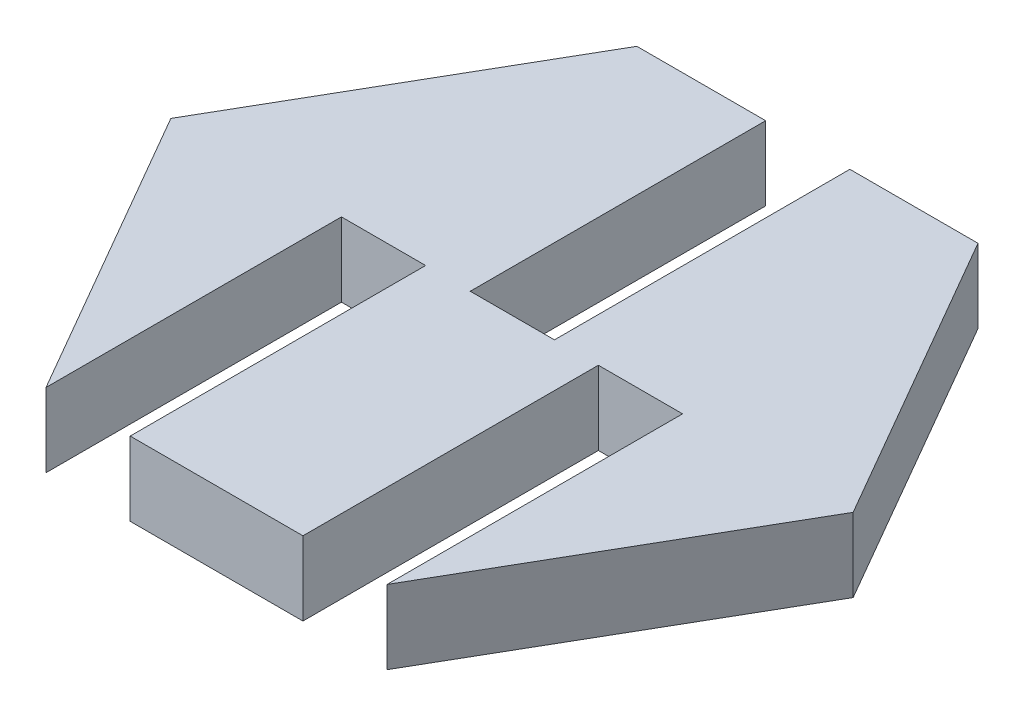
ISO-10303-21;
HEADER;
FILE_DESCRIPTION(('STEP AP214'),'2;1');
FILE_NAME('part.step','',(''),(''),'','','');
FILE_SCHEMA(('AUTOMOTIVE_DESIGN { 1 0 10303 214 1 1 1 1 }'));
ENDSEC;
DATA;
#1=APPLICATION_CONTEXT('core data for automotive mechanical design processes');
#2=APPLICATION_PROTOCOL_DEFINITION('international standard','automotive_design',2000,#1);
#3=PRODUCT_CONTEXT('',#1,'mechanical');
#4=PRODUCT('Part','Part','',(#3));
#5=PRODUCT_RELATED_PRODUCT_CATEGORY('part','',(#4));
#6=PRODUCT_DEFINITION_FORMATION('','',#4);
#7=PRODUCT_DEFINITION_CONTEXT('part definition',#1,'design');
#8=PRODUCT_DEFINITION('design','',#6,#7);
#9=PRODUCT_DEFINITION_SHAPE('','',#8);
#10=(LENGTH_UNIT() NAMED_UNIT(*) SI_UNIT(.MILLI.,.METRE.));
#11=(NAMED_UNIT(*) PLANE_ANGLE_UNIT() SI_UNIT($,.RADIAN.));
#12=(NAMED_UNIT(*) SI_UNIT($,.STERADIAN.) SOLID_ANGLE_UNIT());
#13=UNCERTAINTY_MEASURE_WITH_UNIT(LENGTH_MEASURE(1.E-05),#10,'distance_accuracy_value','');
#14=(GEOMETRIC_REPRESENTATION_CONTEXT(3) GLOBAL_UNCERTAINTY_ASSIGNED_CONTEXT((#13)) GLOBAL_UNIT_ASSIGNED_CONTEXT((#10,
#11,#12)) REPRESENTATION_CONTEXT('',''));
#15=CARTESIAN_POINT('',(0.,0.,0.));
#16=DIRECTION('',(0.,0.,1.));
#17=DIRECTION('',(1.,0.,0.));
#18=AXIS2_PLACEMENT_3D('',#15,#16,#17);
#19=CARTESIAN_POINT('',(5.77350269189625,2.5,-10.));
#20=DIRECTION('',(0.,0.,1.));
#21=DIRECTION('',(1.,0.,0.));
#22=AXIS2_PLACEMENT_3D('',#19,#20,#21);
#23=PLANE('',#22);
#24=DIRECTION('',(-1.,0.,0.));
#25=VECTOR('',#24,1.);
#26=CARTESIAN_POINT('',(5.77350269189625,2.5,-10.));
#27=LINE('',#26,#25);
#28=CARTESIAN_POINT('',(-1.41350269189626,2.5,-10.));
#29=VERTEX_POINT('',#28);
#30=CARTESIAN_POINT('',(-5.77350269189626,2.5,-10.));
#31=VERTEX_POINT('',#30);
#32=EDGE_CURVE('E267',#29,#31,#27,.T.);
#33=ORIENTED_EDGE('',*,*,#32,.F.);
#34=DIRECTION('',(0.,1.,0.));
#35=VECTOR('',#34,1.);
#36=CARTESIAN_POINT('',(-1.41350269189626,2.5,-10.));
#37=LINE('',#36,#35);
#38=CARTESIAN_POINT('',(-1.41350269189626,0.,-10.));
#39=VERTEX_POINT('',#38);
#40=EDGE_CURVE('E159',#39,#29,#37,.T.);
#41=ORIENTED_EDGE('',*,*,#40,.F.);
#42=DIRECTION('',(-1.,0.,0.));
#43=VECTOR('',#42,1.);
#44=CARTESIAN_POINT('',(5.77350269189625,0.,-10.));
#45=LINE('',#44,#43);
#46=CARTESIAN_POINT('',(-5.77350269189626,0.,-10.));
#47=VERTEX_POINT('',#46);
#48=EDGE_CURVE('E289',#39,#47,#45,.T.);
#49=ORIENTED_EDGE('',*,*,#48,.T.);
#50=DIRECTION('',(0.,-1.,0.));
#51=VECTOR('',#50,1.);
#52=CARTESIAN_POINT('',(-5.77350269189626,2.5,-10.));
#53=LINE('',#52,#51);
#54=EDGE_CURVE('E314',#31,#47,#53,.T.);
#55=ORIENTED_EDGE('',*,*,#54,.F.);
#56=EDGE_LOOP('',(#33,#41,#49,#55));
#57=FACE_BOUND('',#56,.T.);
#58=ADVANCED_FACE('F39',(#57),#23,.F.);
#59=CARTESIAN_POINT('',(5.77350269189625,2.5,10.));
#60=DIRECTION('',(-0.866025403784439,0.,-0.5));
#61=DIRECTION('',(-0.5,0.,0.866025403784439));
#62=AXIS2_PLACEMENT_3D('',#59,#60,#61);
#63=PLANE('',#62);
#64=DIRECTION('',(0.5,0.,-0.866025403784439));
#65=VECTOR('',#64,1.);
#66=CARTESIAN_POINT('',(5.77350269189625,0.,10.));
#67=LINE('',#66,#65);
#68=CARTESIAN_POINT('',(5.77350269189625,0.,10.));
#69=VERTEX_POINT('',#68);
#70=CARTESIAN_POINT('',(11.5470053837925,0.,0.));
#71=VERTEX_POINT('',#70);
#72=EDGE_CURVE('E248',#69,#71,#67,.T.);
#73=ORIENTED_EDGE('',*,*,#72,.T.);
#74=DIRECTION('',(0.,-1.,0.));
#75=VECTOR('',#74,1.);
#76=CARTESIAN_POINT('',(11.5470053837925,2.5,0.));
#77=LINE('',#76,#75);
#78=CARTESIAN_POINT('',(11.5470053837925,2.5,0.));
#79=VERTEX_POINT('',#78);
#80=EDGE_CURVE('E11',#79,#71,#77,.T.);
#81=ORIENTED_EDGE('',*,*,#80,.F.);
#82=DIRECTION('',(0.5,0.,-0.866025403784439));
#83=VECTOR('',#82,1.);
#84=CARTESIAN_POINT('',(5.77350269189625,2.5,10.));
#85=LINE('',#84,#83);
#86=CARTESIAN_POINT('',(5.77350269189625,2.5,10.));
#87=VERTEX_POINT('',#86);
#88=EDGE_CURVE('E259',#87,#79,#85,.T.);
#89=ORIENTED_EDGE('',*,*,#88,.F.);
#90=DIRECTION('',(0.,-1.,0.));
#91=VECTOR('',#90,1.);
#92=CARTESIAN_POINT('',(5.77350269189625,2.5,10.));
#93=LINE('',#92,#91);
#94=EDGE_CURVE('E282',#87,#69,#93,.T.);
#95=ORIENTED_EDGE('',*,*,#94,.T.);
#96=EDGE_LOOP('',(#73,#81,#89,#95));
#97=FACE_BOUND('',#96,.T.);
#98=ADVANCED_FACE('F41',(#97),#63,.F.);
#99=CARTESIAN_POINT('',(11.5470053837925,2.5,0.));
#100=DIRECTION('',(-0.866025403784439,0.,0.5));
#101=DIRECTION('',(0.5,0.,0.866025403784439));
#102=AXIS2_PLACEMENT_3D('',#99,#100,#101);
#103=PLANE('',#102);
#104=DIRECTION('',(-0.5,0.,-0.866025403784438));
#105=VECTOR('',#104,1.);
#106=CARTESIAN_POINT('',(11.5470053837925,0.,0.));
#107=LINE('',#106,#105);
#108=CARTESIAN_POINT('',(5.77350269189625,0.,-10.));
#109=VERTEX_POINT('',#108);
#110=EDGE_CURVE('E286',#71,#109,#107,.T.);
#111=ORIENTED_EDGE('',*,*,#110,.T.);
#112=DIRECTION('',(0.,-1.,0.));
#113=VECTOR('',#112,1.);
#114=CARTESIAN_POINT('',(5.77350269189625,2.5,-10.));
#115=LINE('',#114,#113);
#116=CARTESIAN_POINT('',(5.77350269189625,2.5,-10.));
#117=VERTEX_POINT('',#116);
#118=EDGE_CURVE('E48',#117,#109,#115,.T.);
#119=ORIENTED_EDGE('',*,*,#118,.F.);
#120=DIRECTION('',(-0.5,0.,-0.866025403784438));
#121=VECTOR('',#120,1.);
#122=CARTESIAN_POINT('',(11.5470053837925,2.5,0.));
#123=LINE('',#122,#121);
#124=EDGE_CURVE('E263',#79,#117,#123,.T.);
#125=ORIENTED_EDGE('',*,*,#124,.F.);
#126=ORIENTED_EDGE('',*,*,#80,.T.);
#127=EDGE_LOOP('',(#111,#119,#125,#126));
#128=FACE_BOUND('',#127,.T.);
#129=ADVANCED_FACE('F334',(#128),#103,.F.);
#130=CARTESIAN_POINT('',(1.43649730810374,0.,-10.));
#131=VERTEX_POINT('',#130);
#132=EDGE_CURVE('E290',#109,#131,#45,.T.);
#133=ORIENTED_EDGE('',*,*,#132,.T.);
#134=DIRECTION('',(0.,-1.,0.));
#135=VECTOR('',#134,1.);
#136=CARTESIAN_POINT('',(1.43649730810374,2.5,-10.));
#137=LINE('',#136,#135);
#138=CARTESIAN_POINT('',(1.43649730810374,2.5,-10.));
#139=VERTEX_POINT('',#138);
#140=EDGE_CURVE('E173',#139,#131,#137,.T.);
#141=ORIENTED_EDGE('',*,*,#140,.F.);
#142=EDGE_CURVE('E268',#117,#139,#27,.T.);
#143=ORIENTED_EDGE('',*,*,#142,.F.);
#144=ORIENTED_EDGE('',*,*,#118,.T.);
#145=EDGE_LOOP('',(#133,#141,#143,#144));
#146=FACE_BOUND('',#145,.T.);
#147=ADVANCED_FACE('F323',(#146),#23,.F.);
#148=CARTESIAN_POINT('',(-5.77350269189626,2.5,-10.));
#149=DIRECTION('',(0.866025403784439,0.,0.5));
#150=DIRECTION('',(0.5,0.,-0.866025403784439));
#151=AXIS2_PLACEMENT_3D('',#148,#149,#150);
#152=PLANE('',#151);
#153=DIRECTION('',(-0.5,0.,0.866025403784439));
#154=VECTOR('',#153,1.);
#155=CARTESIAN_POINT('',(-5.77350269189626,0.,-10.));
#156=LINE('',#155,#154);
#157=CARTESIAN_POINT('',(-11.5470053837925,0.,0.));
#158=VERTEX_POINT('',#157);
#159=EDGE_CURVE('E294',#47,#158,#156,.T.);
#160=ORIENTED_EDGE('',*,*,#159,.T.);
#161=DIRECTION('',(0.,-1.,0.));
#162=VECTOR('',#161,1.);
#163=CARTESIAN_POINT('',(-11.5470053837925,2.5,0.));
#164=LINE('',#163,#162);
#165=CARTESIAN_POINT('',(-11.5470053837925,2.5,0.));
#166=VERTEX_POINT('',#165);
#167=EDGE_CURVE('E310',#166,#158,#164,.T.);
#168=ORIENTED_EDGE('',*,*,#167,.F.);
#169=DIRECTION('',(-0.5,0.,0.866025403784439));
#170=VECTOR('',#169,1.);
#171=CARTESIAN_POINT('',(-5.77350269189626,2.5,-10.));
#172=LINE('',#171,#170);
#173=EDGE_CURVE('E271',#31,#166,#172,.T.);
#174=ORIENTED_EDGE('',*,*,#173,.F.);
#175=ORIENTED_EDGE('',*,*,#54,.T.);
#176=EDGE_LOOP('',(#160,#168,#174,#175));
#177=FACE_BOUND('',#176,.T.);
#178=ADVANCED_FACE('F360',(#177),#152,.F.);
#179=CARTESIAN_POINT('',(-11.5470053837925,2.5,0.));
#180=DIRECTION('',(0.866025403784439,0.,-0.5));
#181=DIRECTION('',(-0.5,0.,-0.866025403784439));
#182=AXIS2_PLACEMENT_3D('',#179,#180,#181);
#183=PLANE('',#182);
#184=DIRECTION('',(0.5,0.,0.866025403784439));
#185=VECTOR('',#184,1.);
#186=CARTESIAN_POINT('',(-11.5470053837925,0.,0.));
#187=LINE('',#186,#185);
#188=CARTESIAN_POINT('',(-5.77350269189626,0.,10.));
#189=VERTEX_POINT('',#188);
#190=EDGE_CURVE('E297',#158,#189,#187,.T.);
#191=ORIENTED_EDGE('',*,*,#190,.T.);
#192=DIRECTION('',(0.,-1.,0.));
#193=VECTOR('',#192,1.);
#194=CARTESIAN_POINT('',(-5.77350269189626,2.5,10.));
#195=LINE('',#194,#193);
#196=CARTESIAN_POINT('',(-5.77350269189626,2.5,10.));
#197=VERTEX_POINT('',#196);
#198=EDGE_CURVE('E307',#197,#189,#195,.T.);
#199=ORIENTED_EDGE('',*,*,#198,.F.);
#200=DIRECTION('',(0.5,0.,0.866025403784439));
#201=VECTOR('',#200,1.);
#202=CARTESIAN_POINT('',(-11.5470053837925,2.5,0.));
#203=LINE('',#202,#201);
#204=EDGE_CURVE('E274',#166,#197,#203,.T.);
#205=ORIENTED_EDGE('',*,*,#204,.F.);
#206=ORIENTED_EDGE('',*,*,#167,.T.);
#207=EDGE_LOOP('',(#191,#199,#205,#206));
#208=FACE_BOUND('',#207,.T.);
#209=ADVANCED_FACE('F365',(#208),#183,.F.);
#210=CARTESIAN_POINT('',(-5.77350269189626,2.5,10.));
#211=DIRECTION('',(0.,0.,-1.));
#212=DIRECTION('',(-1.,0.,0.));
#213=AXIS2_PLACEMENT_3D('',#210,#211,#212);
#214=PLANE('',#213);
#215=DIRECTION('',(1.,0.,0.));
#216=VECTOR('',#215,1.);
#217=CARTESIAN_POINT('',(-5.77350269189626,0.,10.));
#218=LINE('',#217,#216);
#219=CARTESIAN_POINT('',(-2.92350269189626,0.,10.));
#220=VERTEX_POINT('',#219);
#221=CARTESIAN_POINT('',(2.92350269189626,0.,10.));
#222=VERTEX_POINT('',#221);
#223=EDGE_CURVE('E264',#220,#222,#218,.T.);
#224=ORIENTED_EDGE('',*,*,#223,.T.);
#225=DIRECTION('',(0.,-1.,0.));
#226=VECTOR('',#225,1.);
#227=CARTESIAN_POINT('',(2.92350269189625,2.5,10.));
#228=LINE('',#227,#226);
#229=CARTESIAN_POINT('',(2.92350269189625,2.5,10.));
#230=VERTEX_POINT('',#229);
#231=EDGE_CURVE('E191',#230,#222,#228,.T.);
#232=ORIENTED_EDGE('',*,*,#231,.F.);
#233=DIRECTION('',(1.,0.,0.));
#234=VECTOR('',#233,1.);
#235=CARTESIAN_POINT('',(-5.77350269189626,2.5,10.));
#236=LINE('',#235,#234);
#237=CARTESIAN_POINT('',(-2.92350269189626,2.5,10.));
#238=VERTEX_POINT('',#237);
#239=EDGE_CURVE('E278',#238,#230,#236,.T.);
#240=ORIENTED_EDGE('',*,*,#239,.F.);
#241=DIRECTION('',(0.,1.,0.));
#242=VECTOR('',#241,1.);
#243=CARTESIAN_POINT('',(-2.92350269189626,2.5,10.));
#244=LINE('',#243,#242);
#245=EDGE_CURVE('E216',#220,#238,#244,.T.);
#246=ORIENTED_EDGE('',*,*,#245,.F.);
#247=EDGE_LOOP('',(#224,#232,#240,#246));
#248=FACE_BOUND('',#247,.T.);
#249=ADVANCED_FACE('F385',(#248),#214,.F.);
#250=CARTESIAN_POINT('',(0.,2.5,0.));
#251=DIRECTION('',(0.,1.,0.));
#252=DIRECTION('',(0.,0.,1.));
#253=AXIS2_PLACEMENT_3D('',#250,#251,#252);
#254=PLANE('',#253);
#255=DIRECTION('',(0.,0.,-1.));
#256=VECTOR('',#255,1.);
#257=CARTESIAN_POINT('',(-1.41350269189626,2.5,0.));
#258=LINE('',#257,#256);
#259=CARTESIAN_POINT('',(-1.41350269189626,2.5,0.));
#260=VERTEX_POINT('',#259);
#261=EDGE_CURVE('E154',#260,#29,#258,.T.);
#262=ORIENTED_EDGE('',*,*,#261,.T.);
#263=ORIENTED_EDGE('',*,*,#32,.T.);
#264=ORIENTED_EDGE('',*,*,#173,.T.);
#265=ORIENTED_EDGE('',*,*,#204,.T.);
#266=DIRECTION('',(0.,0.,1.));
#267=VECTOR('',#266,1.);
#268=CARTESIAN_POINT('',(-5.77350269189626,2.5,0.));
#269=LINE('',#268,#267);
#270=CARTESIAN_POINT('',(-5.77350269189626,2.5,0.));
#271=VERTEX_POINT('',#270);
#272=EDGE_CURVE('E245',#271,#197,#269,.T.);
#273=ORIENTED_EDGE('',*,*,#272,.F.);
#274=DIRECTION('',(-1.,0.,0.));
#275=VECTOR('',#274,1.);
#276=CARTESIAN_POINT('',(-5.77350269189626,2.5,0.));
#277=LINE('',#276,#275);
#278=CARTESIAN_POINT('',(-2.92350269189626,2.5,0.));
#279=VERTEX_POINT('',#278);
#280=EDGE_CURVE('E238',#279,#271,#277,.T.);
#281=ORIENTED_EDGE('',*,*,#280,.F.);
#282=DIRECTION('',(0.,0.,1.));
#283=VECTOR('',#282,1.);
#284=CARTESIAN_POINT('',(-2.92350269189626,2.5,0.));
#285=LINE('',#284,#283);
#286=EDGE_CURVE('E249',#279,#238,#285,.T.);
#287=ORIENTED_EDGE('',*,*,#286,.T.);
#288=ORIENTED_EDGE('',*,*,#239,.T.);
#289=DIRECTION('',(0.,0.,1.));
#290=VECTOR('',#289,1.);
#291=CARTESIAN_POINT('',(2.92350269189625,2.5,0.));
#292=LINE('',#291,#290);
#293=CARTESIAN_POINT('',(2.92350269189625,2.5,0.));
#294=VERTEX_POINT('',#293);
#295=EDGE_CURVE('E221',#294,#230,#292,.T.);
#296=ORIENTED_EDGE('',*,*,#295,.F.);
#297=DIRECTION('',(-1.,0.,0.));
#298=VECTOR('',#297,1.);
#299=CARTESIAN_POINT('',(5.77350269189625,2.5,0.));
#300=LINE('',#299,#298);
#301=CARTESIAN_POINT('',(5.77350269189625,2.5,0.));
#302=VERTEX_POINT('',#301);
#303=EDGE_CURVE('E202',#302,#294,#300,.T.);
#304=ORIENTED_EDGE('',*,*,#303,.F.);
#305=DIRECTION('',(0.,0.,1.));
#306=VECTOR('',#305,1.);
#307=CARTESIAN_POINT('',(5.77350269189625,2.5,0.));
#308=LINE('',#307,#306);
#309=EDGE_CURVE('E210',#302,#87,#308,.T.);
#310=ORIENTED_EDGE('',*,*,#309,.T.);
#311=ORIENTED_EDGE('',*,*,#88,.T.);
#312=ORIENTED_EDGE('',*,*,#124,.T.);
#313=ORIENTED_EDGE('',*,*,#142,.T.);
#314=DIRECTION('',(0.,0.,-1.));
#315=VECTOR('',#314,1.);
#316=CARTESIAN_POINT('',(1.43649730810374,2.5,0.));
#317=LINE('',#316,#315);
#318=CARTESIAN_POINT('',(1.43649730810374,2.5,0.));
#319=VERTEX_POINT('',#318);
#320=EDGE_CURVE('E164',#319,#139,#317,.T.);
#321=ORIENTED_EDGE('',*,*,#320,.F.);
#322=DIRECTION('',(1.,0.,0.));
#323=VECTOR('',#322,1.);
#324=CARTESIAN_POINT('',(-1.41350269189626,2.5,0.));
#325=LINE('',#324,#323);
#326=EDGE_CURVE('E168',#260,#319,#325,.T.);
#327=ORIENTED_EDGE('',*,*,#326,.F.);
#328=EDGE_LOOP('',(#262,#263,#264,#265,#273,#281,#287,#288,#296,#304,#310,#311,#312,#313,#321,#327));
#329=FACE_BOUND('',#328,.T.);
#330=ADVANCED_FACE('F175',(#329),#254,.T.);
#331=CARTESIAN_POINT('',(0.,0.,0.));
#332=DIRECTION('',(0.,1.,0.));
#333=DIRECTION('',(0.,0.,1.));
#334=AXIS2_PLACEMENT_3D('',#331,#332,#333);
#335=PLANE('',#334);
#336=ORIENTED_EDGE('',*,*,#48,.F.);
#337=DIRECTION('',(0.,0.,-1.));
#338=VECTOR('',#337,1.);
#339=CARTESIAN_POINT('',(-1.41350269189626,0.,0.));
#340=LINE('',#339,#338);
#341=CARTESIAN_POINT('',(-1.41350269189626,0.,0.));
#342=VERTEX_POINT('',#341);
#343=EDGE_CURVE('E188',#342,#39,#340,.T.);
#344=ORIENTED_EDGE('',*,*,#343,.F.);
#345=DIRECTION('',(-1.,0.,0.));
#346=VECTOR('',#345,1.);
#347=CARTESIAN_POINT('',(-1.41350269189626,0.,0.));
#348=LINE('',#347,#346);
#349=CARTESIAN_POINT('',(1.43649730810374,0.,0.));
#350=VERTEX_POINT('',#349);
#351=EDGE_CURVE('E165',#350,#342,#348,.T.);
#352=ORIENTED_EDGE('',*,*,#351,.F.);
#353=DIRECTION('',(0.,0.,-1.));
#354=VECTOR('',#353,1.);
#355=CARTESIAN_POINT('',(1.43649730810374,0.,0.));
#356=LINE('',#355,#354);
#357=EDGE_CURVE('E192',#350,#131,#356,.T.);
#358=ORIENTED_EDGE('',*,*,#357,.T.);
#359=ORIENTED_EDGE('',*,*,#132,.F.);
#360=ORIENTED_EDGE('',*,*,#110,.F.);
#361=ORIENTED_EDGE('',*,*,#72,.F.);
#362=DIRECTION('',(0.,0.,1.));
#363=VECTOR('',#362,1.);
#364=CARTESIAN_POINT('',(5.77350269189625,0.,0.));
#365=LINE('',#364,#363);
#366=CARTESIAN_POINT('',(5.77350269189625,0.,0.));
#367=VERTEX_POINT('',#366);
#368=EDGE_CURVE('E213',#367,#69,#365,.T.);
#369=ORIENTED_EDGE('',*,*,#368,.F.);
#370=DIRECTION('',(1.,0.,0.));
#371=VECTOR('',#370,1.);
#372=CARTESIAN_POINT('',(5.77350269189625,0.,0.));
#373=LINE('',#372,#371);
#374=CARTESIAN_POINT('',(2.92350269189625,0.,0.));
#375=VERTEX_POINT('',#374);
#376=EDGE_CURVE('E207',#375,#367,#373,.T.);
#377=ORIENTED_EDGE('',*,*,#376,.F.);
#378=DIRECTION('',(0.,0.,1.));
#379=VECTOR('',#378,1.);
#380=CARTESIAN_POINT('',(2.92350269189626,0.,0.));
#381=LINE('',#380,#379);
#382=EDGE_CURVE('E217',#375,#222,#381,.T.);
#383=ORIENTED_EDGE('',*,*,#382,.T.);
#384=ORIENTED_EDGE('',*,*,#223,.F.);
#385=DIRECTION('',(0.,0.,1.));
#386=VECTOR('',#385,1.);
#387=CARTESIAN_POINT('',(-2.92350269189626,0.,0.));
#388=LINE('',#387,#386);
#389=CARTESIAN_POINT('',(-2.92350269189626,0.,0.));
#390=VERTEX_POINT('',#389);
#391=EDGE_CURVE('E253',#390,#220,#388,.T.);
#392=ORIENTED_EDGE('',*,*,#391,.F.);
#393=DIRECTION('',(1.,0.,0.));
#394=VECTOR('',#393,1.);
#395=CARTESIAN_POINT('',(-5.77350269189626,0.,0.));
#396=LINE('',#395,#394);
#397=CARTESIAN_POINT('',(-5.77350269189626,0.,0.));
#398=VERTEX_POINT('',#397);
#399=EDGE_CURVE('E230',#398,#390,#396,.T.);
#400=ORIENTED_EDGE('',*,*,#399,.F.);
#401=DIRECTION('',(0.,0.,1.));
#402=VECTOR('',#401,1.);
#403=CARTESIAN_POINT('',(-5.77350269189626,0.,0.));
#404=LINE('',#403,#402);
#405=EDGE_CURVE('E242',#398,#189,#404,.T.);
#406=ORIENTED_EDGE('',*,*,#405,.T.);
#407=ORIENTED_EDGE('',*,*,#190,.F.);
#408=ORIENTED_EDGE('',*,*,#159,.F.);
#409=EDGE_LOOP('',(#336,#344,#352,#358,#359,#360,#361,#369,#377,#383,#384,#392,#400,#406,#407,#408));
#410=FACE_BOUND('',#409,.T.);
#411=ADVANCED_FACE('F328',(#410),#335,.F.);
#412=CARTESIAN_POINT('',(-5.77350269189626,2.5,0.));
#413=DIRECTION('',(-1.,0.,0.));
#414=DIRECTION('',(0.,0.,1.));
#415=AXIS2_PLACEMENT_3D('',#412,#413,#414);
#416=PLANE('',#415);
#417=ORIENTED_EDGE('',*,*,#198,.T.);
#418=ORIENTED_EDGE('',*,*,#405,.F.);
#419=DIRECTION('',(0.,-1.,0.));
#420=VECTOR('',#419,1.);
#421=CARTESIAN_POINT('',(-5.77350269189626,2.5,0.));
#422=LINE('',#421,#420);
#423=EDGE_CURVE('E227',#271,#398,#422,.T.);
#424=ORIENTED_EDGE('',*,*,#423,.F.);
#425=ORIENTED_EDGE('',*,*,#272,.T.);
#426=EDGE_LOOP('',(#417,#418,#424,#425));
#427=FACE_BOUND('',#426,.T.);
#428=ADVANCED_FACE('F437',(#427),#416,.F.);
#429=CARTESIAN_POINT('',(-2.92350269189626,2.5,0.));
#430=DIRECTION('',(1.,0.,0.));
#431=DIRECTION('',(0.,1.,0.));
#432=AXIS2_PLACEMENT_3D('',#429,#430,#431);
#433=PLANE('',#432);
#434=ORIENTED_EDGE('',*,*,#245,.T.);
#435=ORIENTED_EDGE('',*,*,#286,.F.);
#436=DIRECTION('',(0.,1.,0.));
#437=VECTOR('',#436,1.);
#438=CARTESIAN_POINT('',(-2.92350269189626,2.5,0.));
#439=LINE('',#438,#437);
#440=EDGE_CURVE('E234',#390,#279,#439,.T.);
#441=ORIENTED_EDGE('',*,*,#440,.F.);
#442=ORIENTED_EDGE('',*,*,#391,.T.);
#443=EDGE_LOOP('',(#434,#435,#441,#442));
#444=FACE_BOUND('',#443,.T.);
#445=ADVANCED_FACE('F467',(#444),#433,.F.);
#446=CARTESIAN_POINT('',(0.,0.,0.));
#447=DIRECTION('',(0.,0.,1.));
#448=DIRECTION('',(1.,0.,0.));
#449=AXIS2_PLACEMENT_3D('',#446,#447,#448);
#450=PLANE('',#449);
#451=ORIENTED_EDGE('',*,*,#423,.T.);
#452=ORIENTED_EDGE('',*,*,#399,.T.);
#453=ORIENTED_EDGE('',*,*,#440,.T.);
#454=ORIENTED_EDGE('',*,*,#280,.T.);
#455=EDGE_LOOP('',(#451,#452,#453,#454));
#456=FACE_BOUND('',#455,.T.);
#457=ADVANCED_FACE('F380',(#456),#450,.T.);
#458=CARTESIAN_POINT('',(5.77350269189625,2.5,0.));
#459=DIRECTION('',(1.,0.,0.));
#460=DIRECTION('',(0.,0.,-1.));
#461=AXIS2_PLACEMENT_3D('',#458,#459,#460);
#462=PLANE('',#461);
#463=ORIENTED_EDGE('',*,*,#94,.F.);
#464=ORIENTED_EDGE('',*,*,#309,.F.);
#465=DIRECTION('',(0.,1.,0.));
#466=VECTOR('',#465,1.);
#467=CARTESIAN_POINT('',(5.77350269189625,2.5,0.));
#468=LINE('',#467,#466);
#469=EDGE_CURVE('E198',#367,#302,#468,.T.);
#470=ORIENTED_EDGE('',*,*,#469,.F.);
#471=ORIENTED_EDGE('',*,*,#368,.T.);
#472=EDGE_LOOP('',(#463,#464,#470,#471));
#473=FACE_BOUND('',#472,.T.);
#474=ADVANCED_FACE('F339',(#473),#462,.F.);
#475=CARTESIAN_POINT('',(2.92350269189625,2.5,0.));
#476=DIRECTION('',(-1.,0.,0.));
#477=DIRECTION('',(0.,-1.,0.));
#478=AXIS2_PLACEMENT_3D('',#475,#476,#477);
#479=PLANE('',#478);
#480=ORIENTED_EDGE('',*,*,#231,.T.);
#481=ORIENTED_EDGE('',*,*,#382,.F.);
#482=DIRECTION('',(0.,-1.,0.));
#483=VECTOR('',#482,1.);
#484=CARTESIAN_POINT('',(2.92350269189625,2.5,0.));
#485=LINE('',#484,#483);
#486=EDGE_CURVE('E63',#294,#375,#485,.T.);
#487=ORIENTED_EDGE('',*,*,#486,.F.);
#488=ORIENTED_EDGE('',*,*,#295,.T.);
#489=EDGE_LOOP('',(#480,#481,#487,#488));
#490=FACE_BOUND('',#489,.T.);
#491=ADVANCED_FACE('F343',(#490),#479,.F.);
#492=CARTESIAN_POINT('',(0.,0.,0.));
#493=DIRECTION('',(0.,0.,-1.));
#494=DIRECTION('',(-1.,0.,0.));
#495=AXIS2_PLACEMENT_3D('',#492,#493,#494);
#496=PLANE('',#495);
#497=ORIENTED_EDGE('',*,*,#469,.T.);
#498=ORIENTED_EDGE('',*,*,#303,.T.);
#499=ORIENTED_EDGE('',*,*,#486,.T.);
#500=ORIENTED_EDGE('',*,*,#376,.T.);
#501=EDGE_LOOP('',(#497,#498,#499,#500));
#502=FACE_BOUND('',#501,.T.);
#503=ADVANCED_FACE('F341',(#502),#496,.F.);
#504=CARTESIAN_POINT('',(-1.41350269189626,2.5,0.));
#505=DIRECTION('',(-1.,0.,0.));
#506=DIRECTION('',(0.,-1.,0.));
#507=AXIS2_PLACEMENT_3D('',#504,#505,#506);
#508=PLANE('',#507);
#509=ORIENTED_EDGE('',*,*,#40,.T.);
#510=ORIENTED_EDGE('',*,*,#261,.F.);
#511=DIRECTION('',(0.,1.,0.));
#512=VECTOR('',#511,1.);
#513=CARTESIAN_POINT('',(-1.41350269189626,2.5,0.));
#514=LINE('',#513,#512);
#515=EDGE_CURVE('E157',#342,#260,#514,.T.);
#516=ORIENTED_EDGE('',*,*,#515,.F.);
#517=ORIENTED_EDGE('',*,*,#343,.T.);
#518=EDGE_LOOP('',(#509,#510,#516,#517));
#519=FACE_BOUND('',#518,.T.);
#520=ADVANCED_FACE('F156',(#519),#508,.F.);
#521=CARTESIAN_POINT('',(1.43649730810374,2.5,0.));
#522=DIRECTION('',(1.,0.,0.));
#523=DIRECTION('',(0.,0.,-1.));
#524=AXIS2_PLACEMENT_3D('',#521,#522,#523);
#525=PLANE('',#524);
#526=ORIENTED_EDGE('',*,*,#140,.T.);
#527=ORIENTED_EDGE('',*,*,#357,.F.);
#528=DIRECTION('',(0.,-1.,0.));
#529=VECTOR('',#528,1.);
#530=CARTESIAN_POINT('',(1.43649730810374,2.5,0.));
#531=LINE('',#530,#529);
#532=EDGE_CURVE('E55',#319,#350,#531,.T.);
#533=ORIENTED_EDGE('',*,*,#532,.F.);
#534=ORIENTED_EDGE('',*,*,#320,.T.);
#535=EDGE_LOOP('',(#526,#527,#533,#534));
#536=FACE_BOUND('',#535,.T.);
#537=ADVANCED_FACE('F331',(#536),#525,.F.);
#538=CARTESIAN_POINT('',(0.,0.,0.));
#539=DIRECTION('',(0.,0.,1.));
#540=DIRECTION('',(1.,0.,0.));
#541=AXIS2_PLACEMENT_3D('',#538,#539,#540);
#542=PLANE('',#541);
#543=ORIENTED_EDGE('',*,*,#515,.T.);
#544=ORIENTED_EDGE('',*,*,#326,.T.);
#545=ORIENTED_EDGE('',*,*,#532,.T.);
#546=ORIENTED_EDGE('',*,*,#351,.T.);
#547=EDGE_LOOP('',(#543,#544,#545,#546));
#548=FACE_BOUND('',#547,.T.);
#549=ADVANCED_FACE('F167',(#548),#542,.F.);
#550=CLOSED_SHELL('',(#58,#98,#129,#147,#178,#209,#249,#330,#411,#428,#445,#457,#474,#491,#503,
#520,#537,#549));
#551=MANIFOLD_SOLID_BREP('B2',#550);
#552=ADVANCED_BREP_SHAPE_REPRESENTATION('',(#18,#551),#14);
#553=SHAPE_DEFINITION_REPRESENTATION(#9,#552);
ENDSEC;
END-ISO-10303-21;
